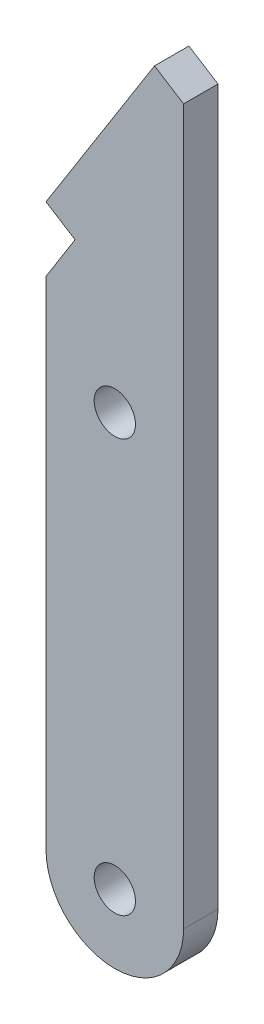
ISO-10303-21;
HEADER;
FILE_DESCRIPTION(('STEP AP214'),'2;1');
FILE_NAME('part.step','',(''),(''),'','','');
FILE_SCHEMA(('AUTOMOTIVE_DESIGN { 1 0 10303 214 1 1 1 1 }'));
ENDSEC;
DATA;
#1=APPLICATION_CONTEXT('core data for automotive mechanical design processes');
#2=APPLICATION_PROTOCOL_DEFINITION('international standard','automotive_design',2000,#1);
#3=PRODUCT_CONTEXT('',#1,'mechanical');
#4=PRODUCT('Part','Part','',(#3));
#5=PRODUCT_RELATED_PRODUCT_CATEGORY('part','',(#4));
#6=PRODUCT_DEFINITION_FORMATION('','',#4);
#7=PRODUCT_DEFINITION_CONTEXT('part definition',#1,'design');
#8=PRODUCT_DEFINITION('design','',#6,#7);
#9=PRODUCT_DEFINITION_SHAPE('','',#8);
#10=(LENGTH_UNIT() NAMED_UNIT(*) SI_UNIT(.MILLI.,.METRE.));
#11=(NAMED_UNIT(*) PLANE_ANGLE_UNIT() SI_UNIT($,.RADIAN.));
#12=(NAMED_UNIT(*) SI_UNIT($,.STERADIAN.) SOLID_ANGLE_UNIT());
#13=UNCERTAINTY_MEASURE_WITH_UNIT(LENGTH_MEASURE(1.E-05),#10,'distance_accuracy_value','');
#14=(GEOMETRIC_REPRESENTATION_CONTEXT(3) GLOBAL_UNCERTAINTY_ASSIGNED_CONTEXT((#13)) GLOBAL_UNIT_ASSIGNED_CONTEXT((#10,
#11,#12)) REPRESENTATION_CONTEXT('',''));
#15=CARTESIAN_POINT('',(0.,0.,0.));
#16=DIRECTION('',(0.,0.,1.));
#17=DIRECTION('',(1.,0.,0.));
#18=AXIS2_PLACEMENT_3D('',#15,#16,#17);
#19=CARTESIAN_POINT('',(0.,0.,2.5));
#20=DIRECTION('',(0.,0.,1.));
#21=DIRECTION('',(1.,0.,0.));
#22=AXIS2_PLACEMENT_3D('',#19,#20,#21);
#23=PLANE('',#22);
#24=CARTESIAN_POINT('',(0.,0.,2.5));
#25=DIRECTION('',(0.,0.,1.));
#26=DIRECTION('',(1.,0.,0.));
#27=AXIS2_PLACEMENT_3D('',#24,#25,#26);
#28=CIRCLE('',#27,1.5);
#29=CARTESIAN_POINT('',(1.5,0.,2.5));
#30=VERTEX_POINT('',#29);
#31=EDGE_CURVE('E127',#30,#30,#28,.T.);
#32=ORIENTED_EDGE('',*,*,#31,.F.);
#33=EDGE_LOOP('',(#32));
#34=FACE_BOUND('',#33,.T.);
#35=CARTESIAN_POINT('',(0.,0.,2.5));
#36=DIRECTION('',(0.,0.,1.));
#37=DIRECTION('',(1.,0.,0.));
#38=AXIS2_PLACEMENT_3D('',#35,#36,#37);
#39=CIRCLE('',#38,5.);
#40=CARTESIAN_POINT('',(-5.,0.,2.5));
#41=VERTEX_POINT('',#40);
#42=CARTESIAN_POINT('',(5.,0.,2.5));
#43=VERTEX_POINT('',#42);
#44=EDGE_CURVE('E136',#41,#43,#39,.T.);
#45=ORIENTED_EDGE('',*,*,#44,.T.);
#46=DIRECTION('',(0.,1.,0.));
#47=VECTOR('',#46,1.);
#48=CARTESIAN_POINT('',(4.99999999999999,51.9286292957323,2.5));
#49=LINE('',#48,#47);
#50=CARTESIAN_POINT('',(4.99999999999999,51.9286292957323,2.5));
#51=VERTEX_POINT('',#50);
#52=EDGE_CURVE('E89',#43,#51,#49,.T.);
#53=ORIENTED_EDGE('',*,*,#52,.T.);
#54=DIRECTION('',(-0.845710517331102,0.533641940701402,0.));
#55=VECTOR('',#54,1.);
#56=CARTESIAN_POINT('',(4.99999999999999,51.9286292957323,2.5));
#57=LINE('',#56,#55);
#58=CARTESIAN_POINT('',(2.88572370668141,53.26273414748,2.5));
#59=VERTEX_POINT('',#58);
#60=EDGE_CURVE('E148',#51,#59,#57,.T.);
#61=ORIENTED_EDGE('',*,*,#60,.T.);
#62=DIRECTION('',(-0.533641940701401,-0.845710517331104,0.));
#63=VECTOR('',#62,1.);
#64=CARTESIAN_POINT('',(2.88572370668141,53.26273414748,2.5));
#65=LINE('',#64,#63);
#66=CARTESIAN_POINT('',(-5.00000000034703,40.7655165055615,2.5));
#67=VERTEX_POINT('',#66);
#68=EDGE_CURVE('E105',#59,#67,#65,.T.);
#69=ORIENTED_EDGE('',*,*,#68,.T.);
#70=DIRECTION('',(0.845710517331224,-0.53364194070121,0.));
#71=VECTOR('',#70,1.);
#72=CARTESIAN_POINT('',(-5.00000000034703,40.7655165055615,2.5));
#73=LINE('',#72,#71);
#74=CARTESIAN_POINT('',(-2.88572370702531,39.4314116538124,2.5));
#75=VERTEX_POINT('',#74);
#76=EDGE_CURVE('E99',#67,#75,#73,.T.);
#77=ORIENTED_EDGE('',*,*,#76,.T.);
#78=DIRECTION('',(-0.533641940701209,-0.845710517331225,0.));
#79=VECTOR('',#78,1.);
#80=CARTESIAN_POINT('',(-2.88572370702531,39.4314116538124,2.5));
#81=LINE('',#80,#79);
#82=CARTESIAN_POINT('',(-4.99999999999999,36.0807273069951,2.5));
#83=VERTEX_POINT('',#82);
#84=EDGE_CURVE('E103',#75,#83,#81,.T.);
#85=ORIENTED_EDGE('',*,*,#84,.T.);
#86=DIRECTION('',(0.,-1.,0.));
#87=VECTOR('',#86,1.);
#88=CARTESIAN_POINT('',(-4.99999999999999,36.0807273069951,2.5));
#89=LINE('',#88,#87);
#90=EDGE_CURVE('E49',#83,#41,#89,.T.);
#91=ORIENTED_EDGE('',*,*,#90,.T.);
#92=EDGE_LOOP('',(#45,#53,#61,#69,#77,#85,#91));
#93=FACE_BOUND('',#92,.T.);
#94=CARTESIAN_POINT('',(0.,30.,2.5));
#95=DIRECTION('',(0.,0.,1.));
#96=DIRECTION('',(1.,0.,0.));
#97=AXIS2_PLACEMENT_3D('',#94,#95,#96);
#98=CIRCLE('',#97,1.5);
#99=CARTESIAN_POINT('',(1.5,30.,2.5));
#100=VERTEX_POINT('',#99);
#101=EDGE_CURVE('E163',#100,#100,#98,.T.);
#102=ORIENTED_EDGE('',*,*,#101,.F.);
#103=EDGE_LOOP('',(#102));
#104=FACE_BOUND('',#103,.T.);
#105=ADVANCED_FACE('F32',(#34,#93,#104),#23,.T.);
#106=CARTESIAN_POINT('',(0.,0.,0.));
#107=DIRECTION('',(0.,0.,1.));
#108=DIRECTION('',(1.,0.,0.));
#109=AXIS2_PLACEMENT_3D('',#106,#107,#108);
#110=PLANE('',#109);
#111=CARTESIAN_POINT('',(0.,0.,0.));
#112=DIRECTION('',(0.,0.,1.));
#113=DIRECTION('',(1.,0.,0.));
#114=AXIS2_PLACEMENT_3D('',#111,#112,#113);
#115=CIRCLE('',#114,1.5);
#116=CARTESIAN_POINT('',(1.5,0.,0.));
#117=VERTEX_POINT('',#116);
#118=EDGE_CURVE('E160',#117,#117,#115,.T.);
#119=ORIENTED_EDGE('',*,*,#118,.T.);
#120=EDGE_LOOP('',(#119));
#121=FACE_BOUND('',#120,.T.);
#122=CARTESIAN_POINT('',(0.,0.,0.));
#123=DIRECTION('',(0.,0.,1.));
#124=DIRECTION('',(1.,0.,0.));
#125=AXIS2_PLACEMENT_3D('',#122,#123,#124);
#126=CIRCLE('',#125,5.);
#127=CARTESIAN_POINT('',(-5.,0.,0.));
#128=VERTEX_POINT('',#127);
#129=CARTESIAN_POINT('',(5.,0.,0.));
#130=VERTEX_POINT('',#129);
#131=EDGE_CURVE('E123',#128,#130,#126,.T.);
#132=ORIENTED_EDGE('',*,*,#131,.F.);
#133=DIRECTION('',(0.,-1.,0.));
#134=VECTOR('',#133,1.);
#135=CARTESIAN_POINT('',(-4.99999999999999,36.0807273069951,0.));
#136=LINE('',#135,#134);
#137=CARTESIAN_POINT('',(-4.99999999999999,36.0807273069951,0.));
#138=VERTEX_POINT('',#137);
#139=EDGE_CURVE('E81',#138,#128,#136,.T.);
#140=ORIENTED_EDGE('',*,*,#139,.F.);
#141=DIRECTION('',(-0.533641940701209,-0.845710517331225,0.));
#142=VECTOR('',#141,1.);
#143=CARTESIAN_POINT('',(-2.88572370702531,39.4314116538124,0.));
#144=LINE('',#143,#142);
#145=CARTESIAN_POINT('',(-2.88572370702531,39.4314116538124,0.));
#146=VERTEX_POINT('',#145);
#147=EDGE_CURVE('E75',#146,#138,#144,.T.);
#148=ORIENTED_EDGE('',*,*,#147,.F.);
#149=DIRECTION('',(0.845710517331224,-0.53364194070121,0.));
#150=VECTOR('',#149,1.);
#151=CARTESIAN_POINT('',(-5.00000000034703,40.7655165055615,0.));
#152=LINE('',#151,#150);
#153=CARTESIAN_POINT('',(-5.00000000034703,40.7655165055615,0.));
#154=VERTEX_POINT('',#153);
#155=EDGE_CURVE('E113',#154,#146,#152,.T.);
#156=ORIENTED_EDGE('',*,*,#155,.F.);
#157=DIRECTION('',(-0.533641940701401,-0.845710517331104,0.));
#158=VECTOR('',#157,1.);
#159=CARTESIAN_POINT('',(2.88572370668141,53.26273414748,0.));
#160=LINE('',#159,#158);
#161=CARTESIAN_POINT('',(2.88572370668141,53.26273414748,0.));
#162=VERTEX_POINT('',#161);
#163=EDGE_CURVE('E131',#162,#154,#160,.T.);
#164=ORIENTED_EDGE('',*,*,#163,.F.);
#165=DIRECTION('',(-0.845710517331102,0.533641940701402,0.));
#166=VECTOR('',#165,1.);
#167=CARTESIAN_POINT('',(4.99999999999999,51.9286292957323,0.));
#168=LINE('',#167,#166);
#169=CARTESIAN_POINT('',(4.99999999999999,51.9286292957323,0.));
#170=VERTEX_POINT('',#169);
#171=EDGE_CURVE('E129',#170,#162,#168,.T.);
#172=ORIENTED_EDGE('',*,*,#171,.F.);
#173=DIRECTION('',(0.,1.,0.));
#174=VECTOR('',#173,1.);
#175=CARTESIAN_POINT('',(4.99999999999999,51.9286292957323,0.));
#176=LINE('',#175,#174);
#177=EDGE_CURVE('E126',#130,#170,#176,.T.);
#178=ORIENTED_EDGE('',*,*,#177,.F.);
#179=EDGE_LOOP('',(#132,#140,#148,#156,#164,#172,#178));
#180=FACE_BOUND('',#179,.T.);
#181=CARTESIAN_POINT('',(0.,30.,0.));
#182=DIRECTION('',(0.,0.,1.));
#183=DIRECTION('',(1.,0.,0.));
#184=AXIS2_PLACEMENT_3D('',#181,#182,#183);
#185=CIRCLE('',#184,1.5);
#186=CARTESIAN_POINT('',(1.5,30.,0.));
#187=VERTEX_POINT('',#186);
#188=EDGE_CURVE('E166',#187,#187,#185,.T.);
#189=ORIENTED_EDGE('',*,*,#188,.T.);
#190=EDGE_LOOP('',(#189));
#191=FACE_BOUND('',#190,.T.);
#192=ADVANCED_FACE('F152',(#121,#180,#191),#110,.F.);
#193=CARTESIAN_POINT('',(0.,0.,2.5));
#194=DIRECTION('',(0.,0.,-1.));
#195=DIRECTION('',(-1.,0.,0.));
#196=AXIS2_PLACEMENT_3D('',#193,#194,#195);
#197=CYLINDRICAL_SURFACE('',#196,5.);
#198=ORIENTED_EDGE('',*,*,#131,.T.);
#199=DIRECTION('',(0.,0.,-1.));
#200=VECTOR('',#199,1.);
#201=CARTESIAN_POINT('',(5.,0.,2.5));
#202=LINE('',#201,#200);
#203=EDGE_CURVE('E11',#43,#130,#202,.T.);
#204=ORIENTED_EDGE('',*,*,#203,.F.);
#205=ORIENTED_EDGE('',*,*,#44,.F.);
#206=DIRECTION('',(0.,0.,-1.));
#207=VECTOR('',#206,1.);
#208=CARTESIAN_POINT('',(-5.,0.,2.5));
#209=LINE('',#208,#207);
#210=EDGE_CURVE('E119',#41,#128,#209,.T.);
#211=ORIENTED_EDGE('',*,*,#210,.T.);
#212=EDGE_LOOP('',(#198,#204,#205,#211));
#213=FACE_BOUND('',#212,.T.);
#214=ADVANCED_FACE('F34',(#213),#197,.T.);
#215=CARTESIAN_POINT('',(4.99999999999999,51.9286292957323,2.5));
#216=DIRECTION('',(-1.,0.,0.));
#217=DIRECTION('',(0.,-1.,0.));
#218=AXIS2_PLACEMENT_3D('',#215,#216,#217);
#219=PLANE('',#218);
#220=ORIENTED_EDGE('',*,*,#177,.T.);
#221=DIRECTION('',(0.,0.,-1.));
#222=VECTOR('',#221,1.);
#223=CARTESIAN_POINT('',(4.99999999999999,51.9286292957323,2.5));
#224=LINE('',#223,#222);
#225=EDGE_CURVE('E41',#51,#170,#224,.T.);
#226=ORIENTED_EDGE('',*,*,#225,.F.);
#227=ORIENTED_EDGE('',*,*,#52,.F.);
#228=ORIENTED_EDGE('',*,*,#203,.T.);
#229=EDGE_LOOP('',(#220,#226,#227,#228));
#230=FACE_BOUND('',#229,.T.);
#231=ADVANCED_FACE('F197',(#230),#219,.F.);
#232=CARTESIAN_POINT('',(4.99999999999999,51.9286292957323,2.5));
#233=DIRECTION('',(-0.533641940701402,-0.845710517331102,0.));
#234=DIRECTION('',(0.845710517331102,-0.533641940701403,0.));
#235=AXIS2_PLACEMENT_3D('',#232,#233,#234);
#236=PLANE('',#235);
#237=ORIENTED_EDGE('',*,*,#171,.T.);
#238=DIRECTION('',(0.,0.,-1.));
#239=VECTOR('',#238,1.);
#240=CARTESIAN_POINT('',(2.88572370668141,53.26273414748,2.5));
#241=LINE('',#240,#239);
#242=EDGE_CURVE('E140',#59,#162,#241,.T.);
#243=ORIENTED_EDGE('',*,*,#242,.F.);
#244=ORIENTED_EDGE('',*,*,#60,.F.);
#245=ORIENTED_EDGE('',*,*,#225,.T.);
#246=EDGE_LOOP('',(#237,#243,#244,#245));
#247=FACE_BOUND('',#246,.T.);
#248=ADVANCED_FACE('F146',(#247),#236,.F.);
#249=CARTESIAN_POINT('',(2.88572370668141,53.26273414748,2.5));
#250=DIRECTION('',(0.845710517331104,-0.533641940701401,0.));
#251=DIRECTION('',(0.533641940701401,0.845710517331104,0.));
#252=AXIS2_PLACEMENT_3D('',#249,#250,#251);
#253=PLANE('',#252);
#254=ORIENTED_EDGE('',*,*,#163,.T.);
#255=DIRECTION('',(0.,0.,-1.));
#256=VECTOR('',#255,1.);
#257=CARTESIAN_POINT('',(-5.00000000034703,40.7655165055615,2.5));
#258=LINE('',#257,#256);
#259=EDGE_CURVE('E114',#67,#154,#258,.T.);
#260=ORIENTED_EDGE('',*,*,#259,.F.);
#261=ORIENTED_EDGE('',*,*,#68,.F.);
#262=ORIENTED_EDGE('',*,*,#242,.T.);
#263=EDGE_LOOP('',(#254,#260,#261,#262));
#264=FACE_BOUND('',#263,.T.);
#265=ADVANCED_FACE('F155',(#264),#253,.F.);
#266=CARTESIAN_POINT('',(-5.00000000034703,40.7655165055615,2.5));
#267=DIRECTION('',(0.53364194070121,0.845710517331224,0.));
#268=DIRECTION('',(-0.845710517331224,0.53364194070121,0.));
#269=AXIS2_PLACEMENT_3D('',#266,#267,#268);
#270=PLANE('',#269);
#271=ORIENTED_EDGE('',*,*,#155,.T.);
#272=DIRECTION('',(0.,0.,-1.));
#273=VECTOR('',#272,1.);
#274=CARTESIAN_POINT('',(-2.88572370702531,39.4314116538124,2.5));
#275=LINE('',#274,#273);
#276=EDGE_CURVE('E110',#75,#146,#275,.T.);
#277=ORIENTED_EDGE('',*,*,#276,.F.);
#278=ORIENTED_EDGE('',*,*,#76,.F.);
#279=ORIENTED_EDGE('',*,*,#259,.T.);
#280=EDGE_LOOP('',(#271,#277,#278,#279));
#281=FACE_BOUND('',#280,.T.);
#282=ADVANCED_FACE('F111',(#281),#270,.F.);
#283=CARTESIAN_POINT('',(-2.88572370702531,39.4314116538124,2.5));
#284=DIRECTION('',(0.845710517331225,-0.533641940701209,0.));
#285=DIRECTION('',(0.533641940701209,0.845710517331225,0.));
#286=AXIS2_PLACEMENT_3D('',#283,#284,#285);
#287=PLANE('',#286);
#288=ORIENTED_EDGE('',*,*,#147,.T.);
#289=DIRECTION('',(0.,0.,-1.));
#290=VECTOR('',#289,1.);
#291=CARTESIAN_POINT('',(-4.99999999999999,36.0807273069951,2.5));
#292=LINE('',#291,#290);
#293=EDGE_CURVE('E115',#83,#138,#292,.T.);
#294=ORIENTED_EDGE('',*,*,#293,.F.);
#295=ORIENTED_EDGE('',*,*,#84,.F.);
#296=ORIENTED_EDGE('',*,*,#276,.T.);
#297=EDGE_LOOP('',(#288,#294,#295,#296));
#298=FACE_BOUND('',#297,.T.);
#299=ADVANCED_FACE('F117',(#298),#287,.F.);
#300=CARTESIAN_POINT('',(-4.99999999999999,36.0807273069951,2.5));
#301=DIRECTION('',(1.,0.,0.));
#302=DIRECTION('',(0.,1.,0.));
#303=AXIS2_PLACEMENT_3D('',#300,#301,#302);
#304=PLANE('',#303);
#305=ORIENTED_EDGE('',*,*,#139,.T.);
#306=ORIENTED_EDGE('',*,*,#210,.F.);
#307=ORIENTED_EDGE('',*,*,#90,.F.);
#308=ORIENTED_EDGE('',*,*,#293,.T.);
#309=EDGE_LOOP('',(#305,#306,#307,#308));
#310=FACE_BOUND('',#309,.T.);
#311=ADVANCED_FACE('F187',(#310),#304,.F.);
#312=CARTESIAN_POINT('',(0.,0.,2.5));
#313=DIRECTION('',(0.,0.,-1.));
#314=DIRECTION('',(-1.,0.,0.));
#315=AXIS2_PLACEMENT_3D('',#312,#313,#314);
#316=CYLINDRICAL_SURFACE('',#315,1.5);
#317=ORIENTED_EDGE('',*,*,#31,.T.);
#318=EDGE_LOOP('',(#317));
#319=FACE_BOUND('',#318,.T.);
#320=ORIENTED_EDGE('',*,*,#118,.F.);
#321=EDGE_LOOP('',(#320));
#322=FACE_BOUND('',#321,.T.);
#323=ADVANCED_FACE('F184',(#319,#322),#316,.F.);
#324=CARTESIAN_POINT('',(0.,30.,2.5));
#325=DIRECTION('',(0.,0.,-1.));
#326=DIRECTION('',(-1.,0.,0.));
#327=AXIS2_PLACEMENT_3D('',#324,#325,#326);
#328=CYLINDRICAL_SURFACE('',#327,1.5);
#329=ORIENTED_EDGE('',*,*,#101,.T.);
#330=EDGE_LOOP('',(#329));
#331=FACE_BOUND('',#330,.T.);
#332=ORIENTED_EDGE('',*,*,#188,.F.);
#333=EDGE_LOOP('',(#332));
#334=FACE_BOUND('',#333,.T.);
#335=ADVANCED_FACE('F172',(#331,#334),#328,.F.);
#336=CLOSED_SHELL('',(#105,#192,#214,#231,#248,#265,#282,#299,#311,#323,#335));
#337=MANIFOLD_SOLID_BREP('B2',#336);
#338=ADVANCED_BREP_SHAPE_REPRESENTATION('',(#18,#337),#14);
#339=SHAPE_DEFINITION_REPRESENTATION(#9,#338);
ENDSEC;
END-ISO-10303-21;
